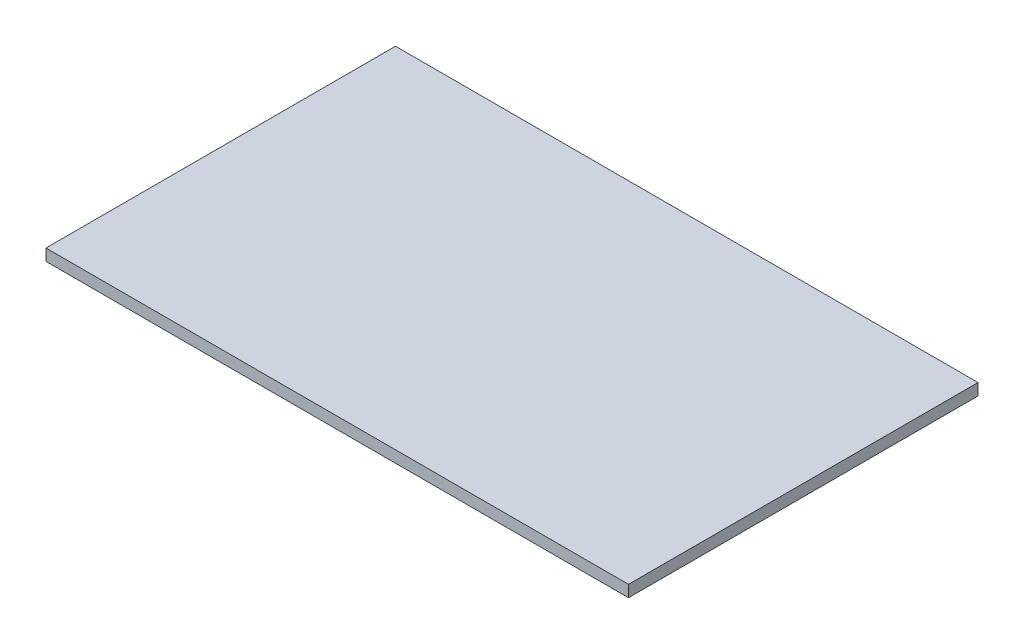
ISO-10303-21;
HEADER;
FILE_DESCRIPTION(('STEP AP214'),'2;1');
FILE_NAME('part.step','',(''),(''),'','','');
FILE_SCHEMA(('AUTOMOTIVE_DESIGN { 1 0 10303 214 1 1 1 1 }'));
ENDSEC;
DATA;
#1=APPLICATION_CONTEXT('core data for automotive mechanical design processes');
#2=APPLICATION_PROTOCOL_DEFINITION('international standard','automotive_design',2000,#1);
#3=PRODUCT_CONTEXT('',#1,'mechanical');
#4=PRODUCT('Part','Part','',(#3));
#5=PRODUCT_RELATED_PRODUCT_CATEGORY('part','',(#4));
#6=PRODUCT_DEFINITION_FORMATION('','',#4);
#7=PRODUCT_DEFINITION_CONTEXT('part definition',#1,'design');
#8=PRODUCT_DEFINITION('design','',#6,#7);
#9=PRODUCT_DEFINITION_SHAPE('','',#8);
#10=(LENGTH_UNIT() NAMED_UNIT(*) SI_UNIT(.MILLI.,.METRE.));
#11=(NAMED_UNIT(*) PLANE_ANGLE_UNIT() SI_UNIT($,.RADIAN.));
#12=(NAMED_UNIT(*) SI_UNIT($,.STERADIAN.) SOLID_ANGLE_UNIT());
#13=UNCERTAINTY_MEASURE_WITH_UNIT(LENGTH_MEASURE(1.E-05),#10,'distance_accuracy_value','');
#14=(GEOMETRIC_REPRESENTATION_CONTEXT(3) GLOBAL_UNCERTAINTY_ASSIGNED_CONTEXT((#13)) GLOBAL_UNIT_ASSIGNED_CONTEXT((#10,
#11,#12)) REPRESENTATION_CONTEXT('',''));
#15=CARTESIAN_POINT('',(0.,0.,0.));
#16=DIRECTION('',(0.,0.,1.));
#17=DIRECTION('',(1.,0.,0.));
#18=AXIS2_PLACEMENT_3D('',#15,#16,#17);
#19=CARTESIAN_POINT('',(-50.,118.619037896906,30.));
#20=DIRECTION('',(0.,0.,-1.));
#21=DIRECTION('',(-1.,0.,0.));
#22=AXIS2_PLACEMENT_3D('',#19,#20,#21);
#23=PLANE('',#22);
#24=DIRECTION('',(0.,-1.,0.));
#25=VECTOR('',#24,1.);
#26=CARTESIAN_POINT('',(50.,118.619037896906,30.));
#27=LINE('',#26,#25);
#28=CARTESIAN_POINT('',(50.,2.,30.));
#29=VERTEX_POINT('',#28);
#30=CARTESIAN_POINT('',(50.,0.,30.));
#31=VERTEX_POINT('',#30);
#32=EDGE_CURVE('E100',#29,#31,#27,.T.);
#33=ORIENTED_EDGE('',*,*,#32,.F.);
#34=DIRECTION('',(-1.,0.,0.));
#35=VECTOR('',#34,1.);
#36=CARTESIAN_POINT('',(-50.,2.,30.));
#37=LINE('',#36,#35);
#38=CARTESIAN_POINT('',(-50.,2.,30.));
#39=VERTEX_POINT('',#38);
#40=EDGE_CURVE('E45',#29,#39,#37,.T.);
#41=ORIENTED_EDGE('',*,*,#40,.T.);
#42=DIRECTION('',(0.,-1.,0.));
#43=VECTOR('',#42,1.);
#44=CARTESIAN_POINT('',(-50.,118.619037896906,30.));
#45=LINE('',#44,#43);
#46=CARTESIAN_POINT('',(-50.,0.,30.));
#47=VERTEX_POINT('',#46);
#48=EDGE_CURVE('E113',#39,#47,#45,.T.);
#49=ORIENTED_EDGE('',*,*,#48,.T.);
#50=DIRECTION('',(1.,0.,0.));
#51=VECTOR('',#50,1.);
#52=CARTESIAN_POINT('',(-50.,0.,30.));
#53=LINE('',#52,#51);
#54=EDGE_CURVE('E108',#47,#31,#53,.T.);
#55=ORIENTED_EDGE('',*,*,#54,.T.);
#56=EDGE_LOOP('',(#33,#41,#49,#55));
#57=FACE_BOUND('',#56,.T.);
#58=ADVANCED_FACE('F41',(#57),#23,.F.);
#59=CARTESIAN_POINT('',(-50.,118.619037896906,-30.));
#60=DIRECTION('',(1.,0.,0.));
#61=DIRECTION('',(0.,0.,-1.));
#62=AXIS2_PLACEMENT_3D('',#59,#60,#61);
#63=PLANE('',#62);
#64=ORIENTED_EDGE('',*,*,#48,.F.);
#65=DIRECTION('',(0.,0.,-1.));
#66=VECTOR('',#65,1.);
#67=CARTESIAN_POINT('',(-50.,2.,-30.));
#68=LINE('',#67,#66);
#69=CARTESIAN_POINT('',(-50.,2.,-30.));
#70=VERTEX_POINT('',#69);
#71=EDGE_CURVE('E121',#39,#70,#68,.T.);
#72=ORIENTED_EDGE('',*,*,#71,.T.);
#73=DIRECTION('',(0.,-1.,0.));
#74=VECTOR('',#73,1.);
#75=CARTESIAN_POINT('',(-50.,118.619037896906,-30.));
#76=LINE('',#75,#74);
#77=CARTESIAN_POINT('',(-50.,0.,-30.));
#78=VERTEX_POINT('',#77);
#79=EDGE_CURVE('E89',#70,#78,#76,.T.);
#80=ORIENTED_EDGE('',*,*,#79,.T.);
#81=DIRECTION('',(0.,0.,1.));
#82=VECTOR('',#81,1.);
#83=CARTESIAN_POINT('',(-50.,0.,-30.));
#84=LINE('',#83,#82);
#85=EDGE_CURVE('E95',#78,#47,#84,.T.);
#86=ORIENTED_EDGE('',*,*,#85,.T.);
#87=EDGE_LOOP('',(#64,#72,#80,#86));
#88=FACE_BOUND('',#87,.T.);
#89=ADVANCED_FACE('F120',(#88),#63,.F.);
#90=CARTESIAN_POINT('',(-50.,118.619037896906,-30.));
#91=DIRECTION('',(0.,0.,1.));
#92=DIRECTION('',(1.,0.,0.));
#93=AXIS2_PLACEMENT_3D('',#90,#91,#92);
#94=PLANE('',#93);
#95=ORIENTED_EDGE('',*,*,#79,.F.);
#96=DIRECTION('',(1.,0.,0.));
#97=VECTOR('',#96,1.);
#98=CARTESIAN_POINT('',(-50.,2.,-30.));
#99=LINE('',#98,#97);
#100=CARTESIAN_POINT('',(50.,2.,-30.));
#101=VERTEX_POINT('',#100);
#102=EDGE_CURVE('E51',#70,#101,#99,.T.);
#103=ORIENTED_EDGE('',*,*,#102,.T.);
#104=DIRECTION('',(0.,-1.,0.));
#105=VECTOR('',#104,1.);
#106=CARTESIAN_POINT('',(50.,118.619037896906,-30.));
#107=LINE('',#106,#105);
#108=CARTESIAN_POINT('',(50.,0.,-30.));
#109=VERTEX_POINT('',#108);
#110=EDGE_CURVE('E81',#101,#109,#107,.T.);
#111=ORIENTED_EDGE('',*,*,#110,.T.);
#112=DIRECTION('',(-1.,0.,0.));
#113=VECTOR('',#112,1.);
#114=CARTESIAN_POINT('',(-50.,0.,-30.));
#115=LINE('',#114,#113);
#116=EDGE_CURVE('E84',#109,#78,#115,.T.);
#117=ORIENTED_EDGE('',*,*,#116,.T.);
#118=EDGE_LOOP('',(#95,#103,#111,#117));
#119=FACE_BOUND('',#118,.T.);
#120=ADVANCED_FACE('F83',(#119),#94,.F.);
#121=CARTESIAN_POINT('',(50.,118.619037896906,-30.));
#122=DIRECTION('',(-1.,0.,0.));
#123=DIRECTION('',(0.,0.,1.));
#124=AXIS2_PLACEMENT_3D('',#121,#122,#123);
#125=PLANE('',#124);
#126=ORIENTED_EDGE('',*,*,#110,.F.);
#127=DIRECTION('',(0.,0.,1.));
#128=VECTOR('',#127,1.);
#129=CARTESIAN_POINT('',(50.,2.,-30.));
#130=LINE('',#129,#128);
#131=EDGE_CURVE('E11',#101,#29,#130,.T.);
#132=ORIENTED_EDGE('',*,*,#131,.T.);
#133=ORIENTED_EDGE('',*,*,#32,.T.);
#134=DIRECTION('',(0.,0.,-1.));
#135=VECTOR('',#134,1.);
#136=CARTESIAN_POINT('',(50.,0.,-30.));
#137=LINE('',#136,#135);
#138=EDGE_CURVE('E93',#31,#109,#137,.T.);
#139=ORIENTED_EDGE('',*,*,#138,.T.);
#140=EDGE_LOOP('',(#126,#132,#133,#139));
#141=FACE_BOUND('',#140,.T.);
#142=ADVANCED_FACE('F98',(#141),#125,.F.);
#143=CARTESIAN_POINT('',(29.5,2.,-12.));
#144=DIRECTION('',(0.,-1.,0.));
#145=DIRECTION('',(0.,0.,-1.));
#146=AXIS2_PLACEMENT_3D('',#143,#144,#145);
#147=PLANE('',#146);
#148=ORIENTED_EDGE('',*,*,#102,.F.);
#149=ORIENTED_EDGE('',*,*,#71,.F.);
#150=ORIENTED_EDGE('',*,*,#40,.F.);
#151=ORIENTED_EDGE('',*,*,#131,.F.);
#152=EDGE_LOOP('',(#148,#149,#150,#151));
#153=FACE_BOUND('',#152,.T.);
#154=ADVANCED_FACE('F137',(#153),#147,.F.);
#155=CARTESIAN_POINT('',(29.5,0.,-12.));
#156=DIRECTION('',(0.,-1.,0.));
#157=DIRECTION('',(0.,0.,-1.));
#158=AXIS2_PLACEMENT_3D('',#155,#156,#157);
#159=PLANE('',#158);
#160=ORIENTED_EDGE('',*,*,#138,.F.);
#161=ORIENTED_EDGE('',*,*,#54,.F.);
#162=ORIENTED_EDGE('',*,*,#85,.F.);
#163=ORIENTED_EDGE('',*,*,#116,.F.);
#164=EDGE_LOOP('',(#160,#161,#162,#163));
#165=FACE_BOUND('',#164,.T.);
#166=ADVANCED_FACE('F43',(#165),#159,.T.);
#167=CLOSED_SHELL('',(#58,#89,#120,#142,#154,#166));
#168=MANIFOLD_SOLID_BREP('B2',#167);
#169=ADVANCED_BREP_SHAPE_REPRESENTATION('',(#18,#168),#14);
#170=SHAPE_DEFINITION_REPRESENTATION(#9,#169);
ENDSEC;
END-ISO-10303-21;
